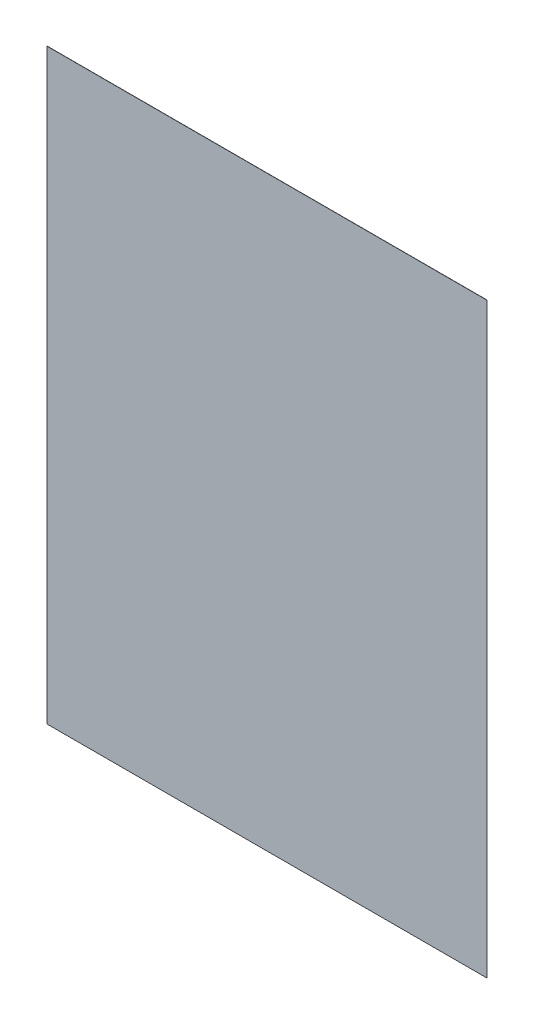
ISO-10303-21;
HEADER;
FILE_DESCRIPTION(('STEP AP214'),'2;1');
FILE_NAME('part.step','',(''),(''),'','','');
FILE_SCHEMA(('AUTOMOTIVE_DESIGN { 1 0 10303 214 1 1 1 1 }'));
ENDSEC;
DATA;
#1=APPLICATION_CONTEXT('core data for automotive mechanical design processes');
#2=APPLICATION_PROTOCOL_DEFINITION('international standard','automotive_design',2000,#1);
#3=PRODUCT_CONTEXT('',#1,'mechanical');
#4=PRODUCT('Part','Part','',(#3));
#5=PRODUCT_RELATED_PRODUCT_CATEGORY('part','',(#4));
#6=PRODUCT_DEFINITION_FORMATION('','',#4);
#7=PRODUCT_DEFINITION_CONTEXT('part definition',#1,'design');
#8=PRODUCT_DEFINITION('design','',#6,#7);
#9=PRODUCT_DEFINITION_SHAPE('','',#8);
#10=(LENGTH_UNIT() NAMED_UNIT(*) SI_UNIT(.MILLI.,.METRE.));
#11=(NAMED_UNIT(*) PLANE_ANGLE_UNIT() SI_UNIT($,.RADIAN.));
#12=(NAMED_UNIT(*) SI_UNIT($,.STERADIAN.) SOLID_ANGLE_UNIT());
#13=UNCERTAINTY_MEASURE_WITH_UNIT(LENGTH_MEASURE(1.E-05),#10,'distance_accuracy_value','');
#14=(GEOMETRIC_REPRESENTATION_CONTEXT(3) GLOBAL_UNCERTAINTY_ASSIGNED_CONTEXT((#13)) GLOBAL_UNIT_ASSIGNED_CONTEXT((#10,
#11,#12)) REPRESENTATION_CONTEXT('',''));
#15=CARTESIAN_POINT('',(0.,0.,0.));
#16=DIRECTION('',(0.,0.,1.));
#17=DIRECTION('',(1.,0.,0.));
#18=AXIS2_PLACEMENT_3D('',#15,#16,#17);
#19=CARTESIAN_POINT('',(77.,102.75,0.0686));
#20=DIRECTION('',(-1.,0.,0.));
#21=DIRECTION('',(0.,-1.,0.));
#22=AXIS2_PLACEMENT_3D('',#19,#20,#21);
#23=PLANE('',#22);
#24=DIRECTION('',(0.,1.,0.));
#25=VECTOR('',#24,1.);
#26=CARTESIAN_POINT('',(77.,102.75,0.));
#27=LINE('',#26,#25);
#28=CARTESIAN_POINT('',(77.,-102.75,0.));
#29=VERTEX_POINT('',#28);
#30=CARTESIAN_POINT('',(77.,102.75,0.));
#31=VERTEX_POINT('',#30);
#32=EDGE_CURVE('E96',#29,#31,#27,.T.);
#33=ORIENTED_EDGE('',*,*,#32,.T.);
#34=DIRECTION('',(0.,0.,-1.));
#35=VECTOR('',#34,1.);
#36=CARTESIAN_POINT('',(77.,102.75,0.0686));
#37=LINE('',#36,#35);
#38=CARTESIAN_POINT('',(77.,102.75,0.0686));
#39=VERTEX_POINT('',#38);
#40=EDGE_CURVE('E11',#39,#31,#37,.T.);
#41=ORIENTED_EDGE('',*,*,#40,.F.);
#42=DIRECTION('',(0.,1.,0.));
#43=VECTOR('',#42,1.);
#44=CARTESIAN_POINT('',(77.,102.75,0.0686));
#45=LINE('',#44,#43);
#46=CARTESIAN_POINT('',(77.,-102.75,0.0686));
#47=VERTEX_POINT('',#46);
#48=EDGE_CURVE('E84',#47,#39,#45,.T.);
#49=ORIENTED_EDGE('',*,*,#48,.F.);
#50=DIRECTION('',(0.,0.,-1.));
#51=VECTOR('',#50,1.);
#52=CARTESIAN_POINT('',(77.,-102.75,0.0686));
#53=LINE('',#52,#51);
#54=EDGE_CURVE('E92',#47,#29,#53,.T.);
#55=ORIENTED_EDGE('',*,*,#54,.T.);
#56=EDGE_LOOP('',(#33,#41,#49,#55));
#57=FACE_BOUND('',#56,.T.);
#58=ADVANCED_FACE('F33',(#57),#23,.F.);
#59=CARTESIAN_POINT('',(-77.,102.75,0.0686));
#60=DIRECTION('',(0.,-1.,0.));
#61=DIRECTION('',(0.,0.,-1.));
#62=AXIS2_PLACEMENT_3D('',#59,#60,#61);
#63=PLANE('',#62);
#64=DIRECTION('',(-1.,0.,0.));
#65=VECTOR('',#64,1.);
#66=CARTESIAN_POINT('',(-77.,102.75,0.));
#67=LINE('',#66,#65);
#68=CARTESIAN_POINT('',(-77.,102.75,0.));
#69=VERTEX_POINT('',#68);
#70=EDGE_CURVE('E88',#31,#69,#67,.T.);
#71=ORIENTED_EDGE('',*,*,#70,.T.);
#72=DIRECTION('',(0.,0.,-1.));
#73=VECTOR('',#72,1.);
#74=CARTESIAN_POINT('',(-77.,102.75,0.0686));
#75=LINE('',#74,#73);
#76=CARTESIAN_POINT('',(-77.,102.75,0.0686));
#77=VERTEX_POINT('',#76);
#78=EDGE_CURVE('E41',#77,#69,#75,.T.);
#79=ORIENTED_EDGE('',*,*,#78,.F.);
#80=DIRECTION('',(-1.,0.,0.));
#81=VECTOR('',#80,1.);
#82=CARTESIAN_POINT('',(-77.,102.75,0.0686));
#83=LINE('',#82,#81);
#84=EDGE_CURVE('E79',#39,#77,#83,.T.);
#85=ORIENTED_EDGE('',*,*,#84,.F.);
#86=ORIENTED_EDGE('',*,*,#40,.T.);
#87=EDGE_LOOP('',(#71,#79,#85,#86));
#88=FACE_BOUND('',#87,.T.);
#89=ADVANCED_FACE('F87',(#88),#63,.F.);
#90=CARTESIAN_POINT('',(-77.,102.75,0.0686));
#91=DIRECTION('',(1.,0.,0.));
#92=DIRECTION('',(0.,1.,0.));
#93=AXIS2_PLACEMENT_3D('',#90,#91,#92);
#94=PLANE('',#93);
#95=DIRECTION('',(0.,-1.,0.));
#96=VECTOR('',#95,1.);
#97=CARTESIAN_POINT('',(-77.,102.75,0.));
#98=LINE('',#97,#96);
#99=CARTESIAN_POINT('',(-77.,-102.75,0.));
#100=VERTEX_POINT('',#99);
#101=EDGE_CURVE('E66',#69,#100,#98,.T.);
#102=ORIENTED_EDGE('',*,*,#101,.T.);
#103=DIRECTION('',(0.,0.,-1.));
#104=VECTOR('',#103,1.);
#105=CARTESIAN_POINT('',(-77.,-102.75,0.0686));
#106=LINE('',#105,#104);
#107=CARTESIAN_POINT('',(-77.,-102.75,0.0686));
#108=VERTEX_POINT('',#107);
#109=EDGE_CURVE('E89',#108,#100,#106,.T.);
#110=ORIENTED_EDGE('',*,*,#109,.F.);
#111=DIRECTION('',(0.,-1.,0.));
#112=VECTOR('',#111,1.);
#113=CARTESIAN_POINT('',(-77.,102.75,0.0686));
#114=LINE('',#113,#112);
#115=EDGE_CURVE('E82',#77,#108,#114,.T.);
#116=ORIENTED_EDGE('',*,*,#115,.F.);
#117=ORIENTED_EDGE('',*,*,#78,.T.);
#118=EDGE_LOOP('',(#102,#110,#116,#117));
#119=FACE_BOUND('',#118,.T.);
#120=ADVANCED_FACE('F90',(#119),#94,.F.);
#121=CARTESIAN_POINT('',(-77.,-102.75,0.0686));
#122=DIRECTION('',(0.,1.,0.));
#123=DIRECTION('',(0.,0.,1.));
#124=AXIS2_PLACEMENT_3D('',#121,#122,#123);
#125=PLANE('',#124);
#126=DIRECTION('',(1.,0.,0.));
#127=VECTOR('',#126,1.);
#128=CARTESIAN_POINT('',(-77.,-102.75,0.));
#129=LINE('',#128,#127);
#130=EDGE_CURVE('E72',#100,#29,#129,.T.);
#131=ORIENTED_EDGE('',*,*,#130,.T.);
#132=ORIENTED_EDGE('',*,*,#54,.F.);
#133=DIRECTION('',(1.,0.,0.));
#134=VECTOR('',#133,1.);
#135=CARTESIAN_POINT('',(-77.,-102.75,0.0686));
#136=LINE('',#135,#134);
#137=EDGE_CURVE('E49',#108,#47,#136,.T.);
#138=ORIENTED_EDGE('',*,*,#137,.F.);
#139=ORIENTED_EDGE('',*,*,#109,.T.);
#140=EDGE_LOOP('',(#131,#132,#138,#139));
#141=FACE_BOUND('',#140,.T.);
#142=ADVANCED_FACE('F103',(#141),#125,.F.);
#143=CARTESIAN_POINT('',(0.,0.,0.0686));
#144=DIRECTION('',(0.,0.,1.));
#145=DIRECTION('',(1.,0.,0.));
#146=AXIS2_PLACEMENT_3D('',#143,#144,#145);
#147=PLANE('',#146);
#148=ORIENTED_EDGE('',*,*,#48,.T.);
#149=ORIENTED_EDGE('',*,*,#84,.T.);
#150=ORIENTED_EDGE('',*,*,#115,.T.);
#151=ORIENTED_EDGE('',*,*,#137,.T.);
#152=EDGE_LOOP('',(#148,#149,#150,#151));
#153=FACE_BOUND('',#152,.T.);
#154=ADVANCED_FACE('F80',(#153),#147,.T.);
#155=CARTESIAN_POINT('',(0.,0.,0.));
#156=DIRECTION('',(0.,0.,1.));
#157=DIRECTION('',(1.,0.,0.));
#158=AXIS2_PLACEMENT_3D('',#155,#156,#157);
#159=PLANE('',#158);
#160=ORIENTED_EDGE('',*,*,#32,.F.);
#161=ORIENTED_EDGE('',*,*,#130,.F.);
#162=ORIENTED_EDGE('',*,*,#101,.F.);
#163=ORIENTED_EDGE('',*,*,#70,.F.);
#164=EDGE_LOOP('',(#160,#161,#162,#163));
#165=FACE_BOUND('',#164,.T.);
#166=ADVANCED_FACE('F106',(#165),#159,.F.);
#167=CLOSED_SHELL('',(#58,#89,#120,#142,#154,#166));
#168=MANIFOLD_SOLID_BREP('B2',#167);
#169=ADVANCED_BREP_SHAPE_REPRESENTATION('',(#18,#168),#14);
#170=SHAPE_DEFINITION_REPRESENTATION(#9,#169);
ENDSEC;
END-ISO-10303-21;
